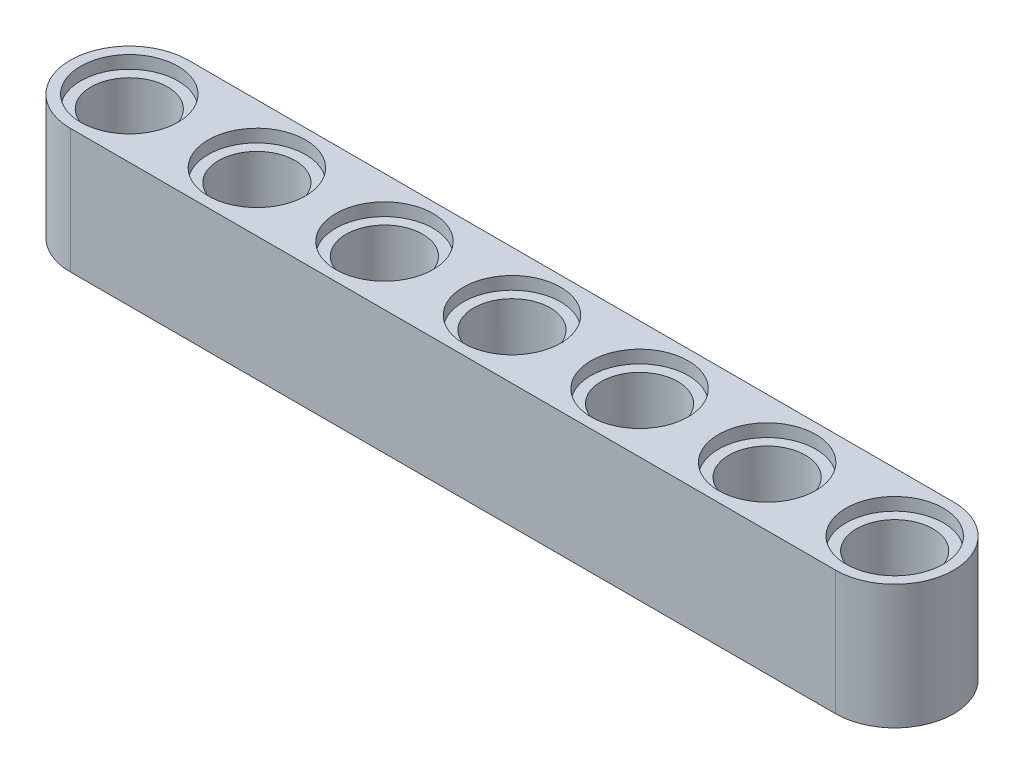
ISO-10303-21;
HEADER;
FILE_DESCRIPTION(('STEP AP214'),'2;1');
FILE_NAME('part.step','',(''),(''),'','','');
FILE_SCHEMA(('AUTOMOTIVE_DESIGN { 1 0 10303 214 1 1 1 1 }'));
ENDSEC;
DATA;
#1=APPLICATION_CONTEXT('core data for automotive mechanical design processes');
#2=APPLICATION_PROTOCOL_DEFINITION('international standard','automotive_design',2000,#1);
#3=PRODUCT_CONTEXT('',#1,'mechanical');
#4=PRODUCT('Part','Part','',(#3));
#5=PRODUCT_RELATED_PRODUCT_CATEGORY('part','',(#4));
#6=PRODUCT_DEFINITION_FORMATION('','',#4);
#7=PRODUCT_DEFINITION_CONTEXT('part definition',#1,'design');
#8=PRODUCT_DEFINITION('design','',#6,#7);
#9=PRODUCT_DEFINITION_SHAPE('','',#8);
#10=(LENGTH_UNIT() NAMED_UNIT(*) SI_UNIT(.MILLI.,.METRE.));
#11=(NAMED_UNIT(*) PLANE_ANGLE_UNIT() SI_UNIT($,.RADIAN.));
#12=(NAMED_UNIT(*) SI_UNIT($,.STERADIAN.) SOLID_ANGLE_UNIT());
#13=UNCERTAINTY_MEASURE_WITH_UNIT(LENGTH_MEASURE(1.E-05),#10,'distance_accuracy_value','');
#14=(GEOMETRIC_REPRESENTATION_CONTEXT(3) GLOBAL_UNCERTAINTY_ASSIGNED_CONTEXT((#13)) GLOBAL_UNIT_ASSIGNED_CONTEXT((#10,
#11,#12)) REPRESENTATION_CONTEXT('',''));
#15=CARTESIAN_POINT('',(0.,0.,0.));
#16=DIRECTION('',(0.,0.,1.));
#17=DIRECTION('',(1.,0.,0.));
#18=AXIS2_PLACEMENT_3D('',#15,#16,#17);
#19=CARTESIAN_POINT('',(0.,0.,0.));
#20=DIRECTION('',(0.,1.,0.));
#21=DIRECTION('',(0.,0.,1.));
#22=AXIS2_PLACEMENT_3D('',#19,#20,#21);
#23=CYLINDRICAL_SURFACE('',#22,2.4);
#24=CARTESIAN_POINT('',(0.,7.,0.));
#25=DIRECTION('',(0.,1.,0.));
#26=DIRECTION('',(0.,0.,1.));
#27=AXIS2_PLACEMENT_3D('',#24,#25,#26);
#28=CIRCLE('',#27,2.4);
#29=CARTESIAN_POINT('',(0.,7.,2.4));
#30=VERTEX_POINT('',#29);
#31=EDGE_CURVE('E109',#30,#30,#28,.F.);
#32=ORIENTED_EDGE('',*,*,#31,.F.);
#33=EDGE_LOOP('',(#32));
#34=FACE_BOUND('',#33,.T.);
#35=CARTESIAN_POINT('',(0.,0.8,0.));
#36=DIRECTION('',(0.,-1.,0.));
#37=DIRECTION('',(0.,0.,-1.));
#38=AXIS2_PLACEMENT_3D('',#35,#36,#37);
#39=CIRCLE('',#38,2.4);
#40=CARTESIAN_POINT('',(0.,0.8,-2.4));
#41=VERTEX_POINT('',#40);
#42=EDGE_CURVE('E40',#41,#41,#39,.F.);
#43=ORIENTED_EDGE('',*,*,#42,.F.);
#44=EDGE_LOOP('',(#43));
#45=FACE_BOUND('',#44,.T.);
#46=ADVANCED_FACE('F36',(#34,#45),#23,.F.);
#47=CARTESIAN_POINT('',(8.,0.,0.));
#48=DIRECTION('',(0.,1.,0.));
#49=DIRECTION('',(0.,0.,1.));
#50=AXIS2_PLACEMENT_3D('',#47,#48,#49);
#51=CYLINDRICAL_SURFACE('',#50,2.4);
#52=CARTESIAN_POINT('',(8.,7.,0.));
#53=DIRECTION('',(0.,1.,0.));
#54=DIRECTION('',(0.,0.,1.));
#55=AXIS2_PLACEMENT_3D('',#52,#53,#54);
#56=CIRCLE('',#55,2.4);
#57=CARTESIAN_POINT('',(8.,7.,2.4));
#58=VERTEX_POINT('',#57);
#59=EDGE_CURVE('E125',#58,#58,#56,.F.);
#60=ORIENTED_EDGE('',*,*,#59,.F.);
#61=EDGE_LOOP('',(#60));
#62=FACE_BOUND('',#61,.T.);
#63=CARTESIAN_POINT('',(8.,0.8,0.));
#64=DIRECTION('',(0.,-1.,0.));
#65=DIRECTION('',(0.,0.,-1.));
#66=AXIS2_PLACEMENT_3D('',#63,#64,#65);
#67=CIRCLE('',#66,2.4);
#68=CARTESIAN_POINT('',(8.,0.8,-2.4));
#69=VERTEX_POINT('',#68);
#70=EDGE_CURVE('E151',#69,#69,#67,.F.);
#71=ORIENTED_EDGE('',*,*,#70,.F.);
#72=EDGE_LOOP('',(#71));
#73=FACE_BOUND('',#72,.T.);
#74=ADVANCED_FACE('F241',(#62,#73),#51,.F.);
#75=CARTESIAN_POINT('',(-16.,0.,0.));
#76=DIRECTION('',(0.,1.,0.));
#77=DIRECTION('',(0.,0.,1.));
#78=AXIS2_PLACEMENT_3D('',#75,#76,#77);
#79=CYLINDRICAL_SURFACE('',#78,2.4);
#80=CARTESIAN_POINT('',(-16.,7.,0.));
#81=DIRECTION('',(0.,1.,0.));
#82=DIRECTION('',(0.,0.,1.));
#83=AXIS2_PLACEMENT_3D('',#80,#81,#82);
#84=CIRCLE('',#83,2.4);
#85=CARTESIAN_POINT('',(-16.,7.,2.4));
#86=VERTEX_POINT('',#85);
#87=EDGE_CURVE('E118',#86,#86,#84,.F.);
#88=ORIENTED_EDGE('',*,*,#87,.F.);
#89=EDGE_LOOP('',(#88));
#90=FACE_BOUND('',#89,.T.);
#91=CARTESIAN_POINT('',(-16.,0.8,0.));
#92=DIRECTION('',(0.,-1.,0.));
#93=DIRECTION('',(0.,0.,-1.));
#94=AXIS2_PLACEMENT_3D('',#91,#92,#93);
#95=CIRCLE('',#94,2.4);
#96=CARTESIAN_POINT('',(-16.,0.8,-2.4));
#97=VERTEX_POINT('',#96);
#98=EDGE_CURVE('E149',#97,#97,#95,.F.);
#99=ORIENTED_EDGE('',*,*,#98,.F.);
#100=EDGE_LOOP('',(#99));
#101=FACE_BOUND('',#100,.T.);
#102=ADVANCED_FACE('F247',(#90,#101),#79,.F.);
#103=CARTESIAN_POINT('',(24.,0.,0.));
#104=DIRECTION('',(0.,1.,0.));
#105=DIRECTION('',(0.,0.,1.));
#106=AXIS2_PLACEMENT_3D('',#103,#104,#105);
#107=CYLINDRICAL_SURFACE('',#106,2.4);
#108=CARTESIAN_POINT('',(24.,7.,0.));
#109=DIRECTION('',(0.,1.,0.));
#110=DIRECTION('',(0.,0.,1.));
#111=AXIS2_PLACEMENT_3D('',#108,#109,#110);
#112=CIRCLE('',#111,2.4);
#113=CARTESIAN_POINT('',(24.,7.,2.4));
#114=VERTEX_POINT('',#113);
#115=EDGE_CURVE('E115',#114,#114,#112,.F.);
#116=ORIENTED_EDGE('',*,*,#115,.F.);
#117=EDGE_LOOP('',(#116));
#118=FACE_BOUND('',#117,.T.);
#119=CARTESIAN_POINT('',(24.,0.8,0.));
#120=DIRECTION('',(0.,-1.,0.));
#121=DIRECTION('',(0.,0.,-1.));
#122=AXIS2_PLACEMENT_3D('',#119,#120,#121);
#123=CIRCLE('',#122,2.4);
#124=CARTESIAN_POINT('',(24.,0.8,-2.4));
#125=VERTEX_POINT('',#124);
#126=EDGE_CURVE('E146',#125,#125,#123,.F.);
#127=ORIENTED_EDGE('',*,*,#126,.F.);
#128=EDGE_LOOP('',(#127));
#129=FACE_BOUND('',#128,.T.);
#130=ADVANCED_FACE('F421',(#118,#129),#107,.F.);
#131=CARTESIAN_POINT('',(-16.,7.8,-3.7));
#132=DIRECTION('',(0.,0.,-1.));
#133=DIRECTION('',(-1.,0.,0.));
#134=AXIS2_PLACEMENT_3D('',#131,#132,#133);
#135=PLANE('',#134);
#136=DIRECTION('',(1.,0.,0.));
#137=VECTOR('',#136,1.);
#138=CARTESIAN_POINT('',(-16.,0.,-3.7));
#139=LINE('',#138,#137);
#140=CARTESIAN_POINT('',(-16.,0.,-3.7));
#141=VERTEX_POINT('',#140);
#142=CARTESIAN_POINT('',(32.,0.,-3.7));
#143=VERTEX_POINT('',#142);
#144=EDGE_CURVE('E105',#141,#143,#139,.T.);
#145=ORIENTED_EDGE('',*,*,#144,.F.);
#146=DIRECTION('',(0.,-1.,0.));
#147=VECTOR('',#146,1.);
#148=CARTESIAN_POINT('',(-16.,7.8,-3.7));
#149=LINE('',#148,#147);
#150=CARTESIAN_POINT('',(-16.,7.8,-3.7));
#151=VERTEX_POINT('',#150);
#152=EDGE_CURVE('E11',#151,#141,#149,.T.);
#153=ORIENTED_EDGE('',*,*,#152,.F.);
#154=DIRECTION('',(1.,0.,0.));
#155=VECTOR('',#154,1.);
#156=CARTESIAN_POINT('',(-16.,7.8,-3.7));
#157=LINE('',#156,#155);
#158=CARTESIAN_POINT('',(32.,7.8,-3.7));
#159=VERTEX_POINT('',#158);
#160=EDGE_CURVE('E99',#151,#159,#157,.T.);
#161=ORIENTED_EDGE('',*,*,#160,.T.);
#162=DIRECTION('',(0.,-1.,0.));
#163=VECTOR('',#162,1.);
#164=CARTESIAN_POINT('',(32.,7.8,-3.7));
#165=LINE('',#164,#163);
#166=EDGE_CURVE('E78',#159,#143,#165,.T.);
#167=ORIENTED_EDGE('',*,*,#166,.T.);
#168=EDGE_LOOP('',(#145,#153,#161,#167));
#169=FACE_BOUND('',#168,.T.);
#170=ADVANCED_FACE('F38',(#169),#135,.T.);
#171=CARTESIAN_POINT('',(-16.,7.8,0.));
#172=DIRECTION('',(0.,-1.,0.));
#173=DIRECTION('',(0.,0.,-1.));
#174=AXIS2_PLACEMENT_3D('',#171,#172,#173);
#175=CYLINDRICAL_SURFACE('',#174,3.7);
#176=CARTESIAN_POINT('',(-16.,0.,0.));
#177=DIRECTION('',(0.,1.,0.));
#178=DIRECTION('',(0.,0.,1.));
#179=AXIS2_PLACEMENT_3D('',#176,#177,#178);
#180=CIRCLE('',#179,3.7);
#181=CARTESIAN_POINT('',(-16.,0.,3.7));
#182=VERTEX_POINT('',#181);
#183=EDGE_CURVE('E70',#141,#182,#180,.T.);
#184=ORIENTED_EDGE('',*,*,#183,.T.);
#185=DIRECTION('',(0.,-1.,0.));
#186=VECTOR('',#185,1.);
#187=CARTESIAN_POINT('',(-16.,7.8,3.7));
#188=LINE('',#187,#186);
#189=CARTESIAN_POINT('',(-16.,7.8,3.7));
#190=VERTEX_POINT('',#189);
#191=EDGE_CURVE('E46',#190,#182,#188,.T.);
#192=ORIENTED_EDGE('',*,*,#191,.F.);
#193=CARTESIAN_POINT('',(-16.,7.8,0.));
#194=DIRECTION('',(0.,1.,0.));
#195=DIRECTION('',(0.,0.,1.));
#196=AXIS2_PLACEMENT_3D('',#193,#194,#195);
#197=CIRCLE('',#196,3.7);
#198=EDGE_CURVE('E88',#151,#190,#197,.T.);
#199=ORIENTED_EDGE('',*,*,#198,.F.);
#200=ORIENTED_EDGE('',*,*,#152,.T.);
#201=EDGE_LOOP('',(#184,#192,#199,#200));
#202=FACE_BOUND('',#201,.T.);
#203=ADVANCED_FACE('F259',(#202),#175,.T.);
#204=CARTESIAN_POINT('',(-16.,7.8,3.7));
#205=DIRECTION('',(0.,0.,-1.));
#206=DIRECTION('',(-1.,0.,0.));
#207=AXIS2_PLACEMENT_3D('',#204,#205,#206);
#208=PLANE('',#207);
#209=DIRECTION('',(1.,0.,0.));
#210=VECTOR('',#209,1.);
#211=CARTESIAN_POINT('',(-16.,0.,3.7));
#212=LINE('',#211,#210);
#213=CARTESIAN_POINT('',(32.,0.,3.7));
#214=VERTEX_POINT('',#213);
#215=EDGE_CURVE('E95',#182,#214,#212,.T.);
#216=ORIENTED_EDGE('',*,*,#215,.T.);
#217=DIRECTION('',(0.,-1.,0.));
#218=VECTOR('',#217,1.);
#219=CARTESIAN_POINT('',(32.,7.8,3.7));
#220=LINE('',#219,#218);
#221=CARTESIAN_POINT('',(32.,7.8,3.7));
#222=VERTEX_POINT('',#221);
#223=EDGE_CURVE('E92',#222,#214,#220,.T.);
#224=ORIENTED_EDGE('',*,*,#223,.F.);
#225=DIRECTION('',(1.,0.,0.));
#226=VECTOR('',#225,1.);
#227=CARTESIAN_POINT('',(-16.,7.8,3.7));
#228=LINE('',#227,#226);
#229=EDGE_CURVE('E83',#190,#222,#228,.T.);
#230=ORIENTED_EDGE('',*,*,#229,.F.);
#231=ORIENTED_EDGE('',*,*,#191,.T.);
#232=EDGE_LOOP('',(#216,#224,#230,#231));
#233=FACE_BOUND('',#232,.T.);
#234=ADVANCED_FACE('F93',(#233),#208,.F.);
#235=CARTESIAN_POINT('',(32.,7.8,0.));
#236=DIRECTION('',(0.,-1.,0.));
#237=DIRECTION('',(0.,0.,-1.));
#238=AXIS2_PLACEMENT_3D('',#235,#236,#237);
#239=CYLINDRICAL_SURFACE('',#238,3.7);
#240=CARTESIAN_POINT('',(32.,0.,0.));
#241=DIRECTION('',(0.,-1.,0.));
#242=DIRECTION('',(0.,0.,-1.));
#243=AXIS2_PLACEMENT_3D('',#240,#241,#242);
#244=CIRCLE('',#243,3.7);
#245=EDGE_CURVE('E108',#143,#214,#244,.T.);
#246=ORIENTED_EDGE('',*,*,#245,.F.);
#247=ORIENTED_EDGE('',*,*,#166,.F.);
#248=CARTESIAN_POINT('',(32.,7.8,0.));
#249=DIRECTION('',(0.,-1.,0.));
#250=DIRECTION('',(0.,0.,-1.));
#251=AXIS2_PLACEMENT_3D('',#248,#249,#250);
#252=CIRCLE('',#251,3.7);
#253=EDGE_CURVE('E87',#159,#222,#252,.T.);
#254=ORIENTED_EDGE('',*,*,#253,.T.);
#255=ORIENTED_EDGE('',*,*,#223,.T.);
#256=EDGE_LOOP('',(#246,#247,#254,#255));
#257=FACE_BOUND('',#256,.T.);
#258=ADVANCED_FACE('F98',(#257),#239,.T.);
#259=CARTESIAN_POINT('',(32.,7.8,0.));
#260=DIRECTION('',(0.,-1.,0.));
#261=DIRECTION('',(0.,0.,-1.));
#262=AXIS2_PLACEMENT_3D('',#259,#260,#261);
#263=PLANE('',#262);
#264=CARTESIAN_POINT('',(24.,7.8,0.));
#265=DIRECTION('',(0.,1.,0.));
#266=DIRECTION('',(0.,0.,1.));
#267=AXIS2_PLACEMENT_3D('',#264,#265,#266);
#268=CIRCLE('',#267,3.05);
#269=CARTESIAN_POINT('',(24.,7.8,3.05));
#270=VERTEX_POINT('',#269);
#271=EDGE_CURVE('E156',#270,#270,#268,.T.);
#272=ORIENTED_EDGE('',*,*,#271,.F.);
#273=EDGE_LOOP('',(#272));
#274=FACE_BOUND('',#273,.T.);
#275=CARTESIAN_POINT('',(32.,7.8,0.));
#276=DIRECTION('',(0.,1.,0.));
#277=DIRECTION('',(0.,0.,-1.));
#278=AXIS2_PLACEMENT_3D('',#275,#276,#277);
#279=CIRCLE('',#278,3.05);
#280=CARTESIAN_POINT('',(32.,7.8,-3.05));
#281=VERTEX_POINT('',#280);
#282=EDGE_CURVE('E165',#281,#281,#279,.T.);
#283=ORIENTED_EDGE('',*,*,#282,.F.);
#284=EDGE_LOOP('',(#283));
#285=FACE_BOUND('',#284,.T.);
#286=CARTESIAN_POINT('',(-8.,7.8,0.));
#287=DIRECTION('',(0.,1.,0.));
#288=DIRECTION('',(0.,0.,-1.));
#289=AXIS2_PLACEMENT_3D('',#286,#287,#288);
#290=CIRCLE('',#289,3.05);
#291=CARTESIAN_POINT('',(-8.,7.8,-3.05));
#292=VERTEX_POINT('',#291);
#293=EDGE_CURVE('E201',#292,#292,#290,.T.);
#294=ORIENTED_EDGE('',*,*,#293,.F.);
#295=EDGE_LOOP('',(#294));
#296=FACE_BOUND('',#295,.T.);
#297=CARTESIAN_POINT('',(-16.,7.8,0.));
#298=DIRECTION('',(0.,1.,0.));
#299=DIRECTION('',(0.,0.,1.));
#300=AXIS2_PLACEMENT_3D('',#297,#298,#299);
#301=CIRCLE('',#300,3.05);
#302=CARTESIAN_POINT('',(-16.,7.8,3.05));
#303=VERTEX_POINT('',#302);
#304=EDGE_CURVE('E195',#303,#303,#301,.T.);
#305=ORIENTED_EDGE('',*,*,#304,.F.);
#306=EDGE_LOOP('',(#305));
#307=FACE_BOUND('',#306,.T.);
#308=CARTESIAN_POINT('',(16.,7.8,0.));
#309=DIRECTION('',(0.,1.,0.));
#310=DIRECTION('',(0.,0.,-1.));
#311=AXIS2_PLACEMENT_3D('',#308,#309,#310);
#312=CIRCLE('',#311,3.05);
#313=CARTESIAN_POINT('',(16.,7.8,-3.05));
#314=VERTEX_POINT('',#313);
#315=EDGE_CURVE('E189',#314,#314,#312,.T.);
#316=ORIENTED_EDGE('',*,*,#315,.F.);
#317=EDGE_LOOP('',(#316));
#318=FACE_BOUND('',#317,.T.);
#319=CARTESIAN_POINT('',(0.,7.8,0.));
#320=DIRECTION('',(0.,1.,0.));
#321=DIRECTION('',(0.,0.,1.));
#322=AXIS2_PLACEMENT_3D('',#319,#320,#321);
#323=CIRCLE('',#322,3.05);
#324=CARTESIAN_POINT('',(0.,7.8,3.05));
#325=VERTEX_POINT('',#324);
#326=EDGE_CURVE('E176',#325,#325,#323,.T.);
#327=ORIENTED_EDGE('',*,*,#326,.F.);
#328=EDGE_LOOP('',(#327));
#329=FACE_BOUND('',#328,.T.);
#330=CARTESIAN_POINT('',(8.,7.8,0.));
#331=DIRECTION('',(0.,1.,0.));
#332=DIRECTION('',(0.,0.,1.));
#333=AXIS2_PLACEMENT_3D('',#330,#331,#332);
#334=CIRCLE('',#333,3.05);
#335=CARTESIAN_POINT('',(8.,7.8,3.05));
#336=VERTEX_POINT('',#335);
#337=EDGE_CURVE('E170',#336,#336,#334,.T.);
#338=ORIENTED_EDGE('',*,*,#337,.F.);
#339=EDGE_LOOP('',(#338));
#340=FACE_BOUND('',#339,.T.);
#341=ORIENTED_EDGE('',*,*,#160,.F.);
#342=ORIENTED_EDGE('',*,*,#198,.T.);
#343=ORIENTED_EDGE('',*,*,#229,.T.);
#344=ORIENTED_EDGE('',*,*,#253,.F.);
#345=EDGE_LOOP('',(#341,#342,#343,#344));
#346=FACE_BOUND('',#345,.T.);
#347=ADVANCED_FACE('F86',(#274,#285,#296,#307,#318,#329,#340,#346),#263,.F.);
#348=CARTESIAN_POINT('',(32.,0.,0.));
#349=DIRECTION('',(0.,-1.,0.));
#350=DIRECTION('',(0.,0.,-1.));
#351=AXIS2_PLACEMENT_3D('',#348,#349,#350);
#352=PLANE('',#351);
#353=CARTESIAN_POINT('',(24.,0.,0.));
#354=DIRECTION('',(0.,-1.,0.));
#355=DIRECTION('',(0.,0.,-1.));
#356=AXIS2_PLACEMENT_3D('',#353,#354,#355);
#357=CIRCLE('',#356,3.05);
#358=CARTESIAN_POINT('',(24.,0.,-3.05));
#359=VERTEX_POINT('',#358);
#360=EDGE_CURVE('E566',#359,#359,#357,.T.);
#361=ORIENTED_EDGE('',*,*,#360,.F.);
#362=EDGE_LOOP('',(#361));
#363=FACE_BOUND('',#362,.T.);
#364=CARTESIAN_POINT('',(32.,0.,0.));
#365=DIRECTION('',(0.,-1.,0.));
#366=DIRECTION('',(0.,0.,1.));
#367=AXIS2_PLACEMENT_3D('',#364,#365,#366);
#368=CIRCLE('',#367,3.05);
#369=CARTESIAN_POINT('',(32.,0.,3.05));
#370=VERTEX_POINT('',#369);
#371=EDGE_CURVE('E561',#370,#370,#368,.T.);
#372=ORIENTED_EDGE('',*,*,#371,.F.);
#373=EDGE_LOOP('',(#372));
#374=FACE_BOUND('',#373,.T.);
#375=CARTESIAN_POINT('',(-8.,0.,0.));
#376=DIRECTION('',(0.,-1.,0.));
#377=DIRECTION('',(0.,0.,1.));
#378=AXIS2_PLACEMENT_3D('',#375,#376,#377);
#379=CIRCLE('',#378,3.05);
#380=CARTESIAN_POINT('',(-8.,0.,3.05));
#381=VERTEX_POINT('',#380);
#382=EDGE_CURVE('E555',#381,#381,#379,.T.);
#383=ORIENTED_EDGE('',*,*,#382,.F.);
#384=EDGE_LOOP('',(#383));
#385=FACE_BOUND('',#384,.T.);
#386=CARTESIAN_POINT('',(-16.,0.,0.));
#387=DIRECTION('',(0.,-1.,0.));
#388=DIRECTION('',(0.,0.,-1.));
#389=AXIS2_PLACEMENT_3D('',#386,#387,#388);
#390=CIRCLE('',#389,3.05);
#391=CARTESIAN_POINT('',(-16.,0.,-3.05));
#392=VERTEX_POINT('',#391);
#393=EDGE_CURVE('E549',#392,#392,#390,.T.);
#394=ORIENTED_EDGE('',*,*,#393,.F.);
#395=EDGE_LOOP('',(#394));
#396=FACE_BOUND('',#395,.T.);
#397=CARTESIAN_POINT('',(16.,0.,0.));
#398=DIRECTION('',(0.,-1.,0.));
#399=DIRECTION('',(0.,0.,1.));
#400=AXIS2_PLACEMENT_3D('',#397,#398,#399);
#401=CIRCLE('',#400,3.05);
#402=CARTESIAN_POINT('',(16.,0.,3.05));
#403=VERTEX_POINT('',#402);
#404=EDGE_CURVE('E543',#403,#403,#401,.T.);
#405=ORIENTED_EDGE('',*,*,#404,.F.);
#406=EDGE_LOOP('',(#405));
#407=FACE_BOUND('',#406,.T.);
#408=CARTESIAN_POINT('',(0.,0.,0.));
#409=DIRECTION('',(0.,-1.,0.));
#410=DIRECTION('',(0.,0.,-1.));
#411=AXIS2_PLACEMENT_3D('',#408,#409,#410);
#412=CIRCLE('',#411,3.05);
#413=CARTESIAN_POINT('',(0.,0.,-3.05));
#414=VERTEX_POINT('',#413);
#415=EDGE_CURVE('E534',#414,#414,#412,.T.);
#416=ORIENTED_EDGE('',*,*,#415,.F.);
#417=EDGE_LOOP('',(#416));
#418=FACE_BOUND('',#417,.T.);
#419=CARTESIAN_POINT('',(8.,0.,0.));
#420=DIRECTION('',(0.,-1.,0.));
#421=DIRECTION('',(0.,0.,-1.));
#422=AXIS2_PLACEMENT_3D('',#419,#420,#421);
#423=CIRCLE('',#422,3.05);
#424=CARTESIAN_POINT('',(8.,0.,-3.05));
#425=VERTEX_POINT('',#424);
#426=EDGE_CURVE('E184',#425,#425,#423,.T.);
#427=ORIENTED_EDGE('',*,*,#426,.F.);
#428=EDGE_LOOP('',(#427));
#429=FACE_BOUND('',#428,.T.);
#430=ORIENTED_EDGE('',*,*,#144,.T.);
#431=ORIENTED_EDGE('',*,*,#245,.T.);
#432=ORIENTED_EDGE('',*,*,#215,.F.);
#433=ORIENTED_EDGE('',*,*,#183,.F.);
#434=EDGE_LOOP('',(#430,#431,#432,#433));
#435=FACE_BOUND('',#434,.T.);
#436=ADVANCED_FACE('F213',(#363,#374,#385,#396,#407,#418,#429,#435),#352,.T.);
#437=CARTESIAN_POINT('',(32.,0.,0.));
#438=DIRECTION('',(0.,1.,0.));
#439=DIRECTION('',(0.,0.,1.));
#440=AXIS2_PLACEMENT_3D('',#437,#438,#439);
#441=CYLINDRICAL_SURFACE('',#440,2.4);
#442=CARTESIAN_POINT('',(32.,0.8,0.));
#443=DIRECTION('',(0.,1.,0.));
#444=DIRECTION('',(0.,0.,1.));
#445=AXIS2_PLACEMENT_3D('',#442,#443,#444);
#446=CIRCLE('',#445,2.4);
#447=CARTESIAN_POINT('',(32.,0.8,2.4));
#448=VERTEX_POINT('',#447);
#449=EDGE_CURVE('E143',#448,#448,#446,.F.);
#450=ORIENTED_EDGE('',*,*,#449,.T.);
#451=EDGE_LOOP('',(#450));
#452=FACE_BOUND('',#451,.T.);
#453=CARTESIAN_POINT('',(32.,7.,0.));
#454=DIRECTION('',(0.,-1.,0.));
#455=DIRECTION('',(0.,0.,-1.));
#456=AXIS2_PLACEMENT_3D('',#453,#454,#455);
#457=CIRCLE('',#456,2.4);
#458=CARTESIAN_POINT('',(32.,7.,-2.4));
#459=VERTEX_POINT('',#458);
#460=EDGE_CURVE('E131',#459,#459,#457,.F.);
#461=ORIENTED_EDGE('',*,*,#460,.T.);
#462=EDGE_LOOP('',(#461));
#463=FACE_BOUND('',#462,.T.);
#464=ADVANCED_FACE('F257',(#452,#463),#441,.F.);
#465=CARTESIAN_POINT('',(-8.,0.,0.));
#466=DIRECTION('',(0.,1.,0.));
#467=DIRECTION('',(0.,0.,1.));
#468=AXIS2_PLACEMENT_3D('',#465,#466,#467);
#469=CYLINDRICAL_SURFACE('',#468,2.4);
#470=CARTESIAN_POINT('',(-8.,0.8,0.));
#471=DIRECTION('',(0.,1.,0.));
#472=DIRECTION('',(0.,0.,1.));
#473=AXIS2_PLACEMENT_3D('',#470,#471,#472);
#474=CIRCLE('',#473,2.4);
#475=CARTESIAN_POINT('',(-8.,0.8,2.4));
#476=VERTEX_POINT('',#475);
#477=EDGE_CURVE('E139',#476,#476,#474,.F.);
#478=ORIENTED_EDGE('',*,*,#477,.T.);
#479=EDGE_LOOP('',(#478));
#480=FACE_BOUND('',#479,.T.);
#481=CARTESIAN_POINT('',(-8.,7.,0.));
#482=DIRECTION('',(0.,-1.,0.));
#483=DIRECTION('',(0.,0.,-1.));
#484=AXIS2_PLACEMENT_3D('',#481,#482,#483);
#485=CIRCLE('',#484,2.4);
#486=CARTESIAN_POINT('',(-8.,7.,-2.4));
#487=VERTEX_POINT('',#486);
#488=EDGE_CURVE('E128',#487,#487,#485,.F.);
#489=ORIENTED_EDGE('',*,*,#488,.T.);
#490=EDGE_LOOP('',(#489));
#491=FACE_BOUND('',#490,.T.);
#492=ADVANCED_FACE('F284',(#480,#491),#469,.F.);
#493=CARTESIAN_POINT('',(16.,0.,0.));
#494=DIRECTION('',(0.,1.,0.));
#495=DIRECTION('',(0.,0.,1.));
#496=AXIS2_PLACEMENT_3D('',#493,#494,#495);
#497=CYLINDRICAL_SURFACE('',#496,2.4);
#498=CARTESIAN_POINT('',(16.,0.8,0.));
#499=DIRECTION('',(0.,1.,0.));
#500=DIRECTION('',(0.,0.,1.));
#501=AXIS2_PLACEMENT_3D('',#498,#499,#500);
#502=CIRCLE('',#501,2.4);
#503=CARTESIAN_POINT('',(16.,0.8,2.4));
#504=VERTEX_POINT('',#503);
#505=EDGE_CURVE('E136',#504,#504,#502,.F.);
#506=ORIENTED_EDGE('',*,*,#505,.T.);
#507=EDGE_LOOP('',(#506));
#508=FACE_BOUND('',#507,.T.);
#509=CARTESIAN_POINT('',(16.,7.,0.));
#510=DIRECTION('',(0.,-1.,0.));
#511=DIRECTION('',(0.,0.,-1.));
#512=AXIS2_PLACEMENT_3D('',#509,#510,#511);
#513=CIRCLE('',#512,2.4);
#514=CARTESIAN_POINT('',(16.,7.,-2.4));
#515=VERTEX_POINT('',#514);
#516=EDGE_CURVE('E122',#515,#515,#513,.F.);
#517=ORIENTED_EDGE('',*,*,#516,.T.);
#518=EDGE_LOOP('',(#517));
#519=FACE_BOUND('',#518,.T.);
#520=ADVANCED_FACE('F253',(#508,#519),#497,.F.);
#521=CARTESIAN_POINT('',(24.,7.,0.));
#522=DIRECTION('',(0.,1.,0.));
#523=DIRECTION('',(0.,0.,1.));
#524=AXIS2_PLACEMENT_3D('',#521,#522,#523);
#525=PLANE('',#524);
#526=CARTESIAN_POINT('',(24.,7.,0.));
#527=DIRECTION('',(0.,1.,0.));
#528=DIRECTION('',(0.,0.,1.));
#529=AXIS2_PLACEMENT_3D('',#526,#527,#528);
#530=CIRCLE('',#529,3.05);
#531=CARTESIAN_POINT('',(24.,7.,3.05));
#532=VERTEX_POINT('',#531);
#533=EDGE_CURVE('E160',#532,#532,#530,.T.);
#534=ORIENTED_EDGE('',*,*,#533,.T.);
#535=EDGE_LOOP('',(#534));
#536=FACE_BOUND('',#535,.T.);
#537=ORIENTED_EDGE('',*,*,#115,.T.);
#538=EDGE_LOOP('',(#537));
#539=FACE_BOUND('',#538,.T.);
#540=ADVANCED_FACE('F299',(#536,#539),#525,.T.);
#541=CARTESIAN_POINT('',(24.,7.,0.));
#542=DIRECTION('',(0.,1.,0.));
#543=DIRECTION('',(0.,0.,1.));
#544=AXIS2_PLACEMENT_3D('',#541,#542,#543);
#545=CYLINDRICAL_SURFACE('',#544,3.05);
#546=ORIENTED_EDGE('',*,*,#533,.F.);
#547=EDGE_LOOP('',(#546));
#548=FACE_BOUND('',#547,.T.);
#549=ORIENTED_EDGE('',*,*,#271,.T.);
#550=EDGE_LOOP('',(#549));
#551=FACE_BOUND('',#550,.T.);
#552=ADVANCED_FACE('F306',(#548,#551),#545,.F.);
#553=CARTESIAN_POINT('',(-16.,7.,0.));
#554=DIRECTION('',(0.,1.,0.));
#555=DIRECTION('',(0.,0.,1.));
#556=AXIS2_PLACEMENT_3D('',#553,#554,#555);
#557=PLANE('',#556);
#558=CARTESIAN_POINT('',(-16.,7.,0.));
#559=DIRECTION('',(0.,1.,0.));
#560=DIRECTION('',(0.,0.,1.));
#561=AXIS2_PLACEMENT_3D('',#558,#559,#560);
#562=CIRCLE('',#561,3.05);
#563=CARTESIAN_POINT('',(-16.,7.,3.05));
#564=VERTEX_POINT('',#563);
#565=EDGE_CURVE('E192',#564,#564,#562,.T.);
#566=ORIENTED_EDGE('',*,*,#565,.T.);
#567=EDGE_LOOP('',(#566));
#568=FACE_BOUND('',#567,.T.);
#569=ORIENTED_EDGE('',*,*,#87,.T.);
#570=EDGE_LOOP('',(#569));
#571=FACE_BOUND('',#570,.T.);
#572=ADVANCED_FACE('F314',(#568,#571),#557,.T.);
#573=CARTESIAN_POINT('',(-16.,7.,0.));
#574=DIRECTION('',(0.,1.,0.));
#575=DIRECTION('',(0.,0.,1.));
#576=AXIS2_PLACEMENT_3D('',#573,#574,#575);
#577=CYLINDRICAL_SURFACE('',#576,3.05);
#578=ORIENTED_EDGE('',*,*,#565,.F.);
#579=EDGE_LOOP('',(#578));
#580=FACE_BOUND('',#579,.T.);
#581=ORIENTED_EDGE('',*,*,#304,.T.);
#582=EDGE_LOOP('',(#581));
#583=FACE_BOUND('',#582,.T.);
#584=ADVANCED_FACE('F322',(#580,#583),#577,.F.);
#585=CARTESIAN_POINT('',(16.,7.,0.));
#586=DIRECTION('',(0.,-1.,0.));
#587=DIRECTION('',(0.,0.,-1.));
#588=AXIS2_PLACEMENT_3D('',#585,#586,#587);
#589=PLANE('',#588);
#590=CARTESIAN_POINT('',(16.,7.,0.));
#591=DIRECTION('',(0.,1.,0.));
#592=DIRECTION('',(0.,0.,-1.));
#593=AXIS2_PLACEMENT_3D('',#590,#591,#592);
#594=CIRCLE('',#593,3.05);
#595=CARTESIAN_POINT('',(16.,7.,-3.05));
#596=VERTEX_POINT('',#595);
#597=EDGE_CURVE('E181',#596,#596,#594,.T.);
#598=ORIENTED_EDGE('',*,*,#597,.T.);
#599=EDGE_LOOP('',(#598));
#600=FACE_BOUND('',#599,.T.);
#601=ORIENTED_EDGE('',*,*,#516,.F.);
#602=EDGE_LOOP('',(#601));
#603=FACE_BOUND('',#602,.T.);
#604=ADVANCED_FACE('F330',(#600,#603),#589,.F.);
#605=CARTESIAN_POINT('',(16.,7.,0.));
#606=DIRECTION('',(0.,1.,0.));
#607=DIRECTION('',(0.,0.,1.));
#608=AXIS2_PLACEMENT_3D('',#605,#606,#607);
#609=CYLINDRICAL_SURFACE('',#608,3.05);
#610=ORIENTED_EDGE('',*,*,#597,.F.);
#611=EDGE_LOOP('',(#610));
#612=FACE_BOUND('',#611,.T.);
#613=ORIENTED_EDGE('',*,*,#315,.T.);
#614=EDGE_LOOP('',(#613));
#615=FACE_BOUND('',#614,.T.);
#616=ADVANCED_FACE('F338',(#612,#615),#609,.F.);
#617=CARTESIAN_POINT('',(8.,7.,0.));
#618=DIRECTION('',(0.,1.,0.));
#619=DIRECTION('',(0.,0.,1.));
#620=AXIS2_PLACEMENT_3D('',#617,#618,#619);
#621=PLANE('',#620);
#622=CARTESIAN_POINT('',(8.,7.,0.));
#623=DIRECTION('',(0.,1.,0.));
#624=DIRECTION('',(0.,0.,1.));
#625=AXIS2_PLACEMENT_3D('',#622,#623,#624);
#626=CIRCLE('',#625,3.05);
#627=CARTESIAN_POINT('',(8.,7.,3.05));
#628=VERTEX_POINT('',#627);
#629=EDGE_CURVE('E119',#628,#628,#626,.T.);
#630=ORIENTED_EDGE('',*,*,#629,.T.);
#631=EDGE_LOOP('',(#630));
#632=FACE_BOUND('',#631,.T.);
#633=ORIENTED_EDGE('',*,*,#59,.T.);
#634=EDGE_LOOP('',(#633));
#635=FACE_BOUND('',#634,.T.);
#636=ADVANCED_FACE('F345',(#632,#635),#621,.T.);
#637=CARTESIAN_POINT('',(8.,7.,0.));
#638=DIRECTION('',(0.,1.,0.));
#639=DIRECTION('',(0.,0.,1.));
#640=AXIS2_PLACEMENT_3D('',#637,#638,#639);
#641=CYLINDRICAL_SURFACE('',#640,3.05);
#642=ORIENTED_EDGE('',*,*,#629,.F.);
#643=EDGE_LOOP('',(#642));
#644=FACE_BOUND('',#643,.T.);
#645=ORIENTED_EDGE('',*,*,#337,.T.);
#646=EDGE_LOOP('',(#645));
#647=FACE_BOUND('',#646,.T.);
#648=ADVANCED_FACE('F353',(#644,#647),#641,.F.);
#649=CARTESIAN_POINT('',(-8.,7.,0.));
#650=DIRECTION('',(0.,-1.,0.));
#651=DIRECTION('',(0.,0.,-1.));
#652=AXIS2_PLACEMENT_3D('',#649,#650,#651);
#653=PLANE('',#652);
#654=CARTESIAN_POINT('',(-8.,7.,0.));
#655=DIRECTION('',(0.,1.,0.));
#656=DIRECTION('',(0.,0.,-1.));
#657=AXIS2_PLACEMENT_3D('',#654,#655,#656);
#658=CIRCLE('',#657,3.05);
#659=CARTESIAN_POINT('',(-8.,7.,-3.05));
#660=VERTEX_POINT('',#659);
#661=EDGE_CURVE('E198',#660,#660,#658,.T.);
#662=ORIENTED_EDGE('',*,*,#661,.T.);
#663=EDGE_LOOP('',(#662));
#664=FACE_BOUND('',#663,.T.);
#665=ORIENTED_EDGE('',*,*,#488,.F.);
#666=EDGE_LOOP('',(#665));
#667=FACE_BOUND('',#666,.T.);
#668=ADVANCED_FACE('F361',(#664,#667),#653,.F.);
#669=CARTESIAN_POINT('',(-8.,7.,0.));
#670=DIRECTION('',(0.,1.,0.));
#671=DIRECTION('',(0.,0.,1.));
#672=AXIS2_PLACEMENT_3D('',#669,#670,#671);
#673=CYLINDRICAL_SURFACE('',#672,3.05);
#674=ORIENTED_EDGE('',*,*,#661,.F.);
#675=EDGE_LOOP('',(#674));
#676=FACE_BOUND('',#675,.T.);
#677=ORIENTED_EDGE('',*,*,#293,.T.);
#678=EDGE_LOOP('',(#677));
#679=FACE_BOUND('',#678,.T.);
#680=ADVANCED_FACE('F369',(#676,#679),#673,.F.);
#681=CARTESIAN_POINT('',(32.,7.,0.));
#682=DIRECTION('',(0.,-1.,0.));
#683=DIRECTION('',(0.,0.,-1.));
#684=AXIS2_PLACEMENT_3D('',#681,#682,#683);
#685=PLANE('',#684);
#686=CARTESIAN_POINT('',(32.,7.,0.));
#687=DIRECTION('',(0.,1.,0.));
#688=DIRECTION('',(0.,0.,-1.));
#689=AXIS2_PLACEMENT_3D('',#686,#687,#688);
#690=CIRCLE('',#689,3.05);
#691=CARTESIAN_POINT('',(32.,7.,-3.05));
#692=VERTEX_POINT('',#691);
#693=EDGE_CURVE('E204',#692,#692,#690,.T.);
#694=ORIENTED_EDGE('',*,*,#693,.T.);
#695=EDGE_LOOP('',(#694));
#696=FACE_BOUND('',#695,.T.);
#697=ORIENTED_EDGE('',*,*,#460,.F.);
#698=EDGE_LOOP('',(#697));
#699=FACE_BOUND('',#698,.T.);
#700=ADVANCED_FACE('F377',(#696,#699),#685,.F.);
#701=CARTESIAN_POINT('',(32.,7.,0.));
#702=DIRECTION('',(0.,1.,0.));
#703=DIRECTION('',(0.,0.,1.));
#704=AXIS2_PLACEMENT_3D('',#701,#702,#703);
#705=CYLINDRICAL_SURFACE('',#704,3.05);
#706=ORIENTED_EDGE('',*,*,#693,.F.);
#707=EDGE_LOOP('',(#706));
#708=FACE_BOUND('',#707,.T.);
#709=ORIENTED_EDGE('',*,*,#282,.T.);
#710=EDGE_LOOP('',(#709));
#711=FACE_BOUND('',#710,.T.);
#712=ADVANCED_FACE('F209',(#708,#711),#705,.F.);
#713=CARTESIAN_POINT('',(0.,7.,0.));
#714=DIRECTION('',(0.,1.,0.));
#715=DIRECTION('',(0.,0.,1.));
#716=AXIS2_PLACEMENT_3D('',#713,#714,#715);
#717=PLANE('',#716);
#718=CARTESIAN_POINT('',(0.,7.,0.));
#719=DIRECTION('',(0.,1.,0.));
#720=DIRECTION('',(0.,0.,1.));
#721=AXIS2_PLACEMENT_3D('',#718,#719,#720);
#722=CIRCLE('',#721,3.05);
#723=CARTESIAN_POINT('',(0.,7.,3.05));
#724=VERTEX_POINT('',#723);
#725=EDGE_CURVE('E172',#724,#724,#722,.T.);
#726=ORIENTED_EDGE('',*,*,#725,.T.);
#727=EDGE_LOOP('',(#726));
#728=FACE_BOUND('',#727,.T.);
#729=ORIENTED_EDGE('',*,*,#31,.T.);
#730=EDGE_LOOP('',(#729));
#731=FACE_BOUND('',#730,.T.);
#732=ADVANCED_FACE('F228',(#728,#731),#717,.T.);
#733=CARTESIAN_POINT('',(0.,7.,0.));
#734=DIRECTION('',(0.,1.,0.));
#735=DIRECTION('',(0.,0.,1.));
#736=AXIS2_PLACEMENT_3D('',#733,#734,#735);
#737=CYLINDRICAL_SURFACE('',#736,3.05);
#738=ORIENTED_EDGE('',*,*,#725,.F.);
#739=EDGE_LOOP('',(#738));
#740=FACE_BOUND('',#739,.T.);
#741=ORIENTED_EDGE('',*,*,#326,.T.);
#742=EDGE_LOOP('',(#741));
#743=FACE_BOUND('',#742,.T.);
#744=ADVANCED_FACE('F225',(#740,#743),#737,.F.);
#745=CARTESIAN_POINT('',(16.,0.8,0.));
#746=DIRECTION('',(0.,1.,0.));
#747=DIRECTION('',(0.,0.,1.));
#748=AXIS2_PLACEMENT_3D('',#745,#746,#747);
#749=PLANE('',#748);
#750=CARTESIAN_POINT('',(16.,0.8,0.));
#751=DIRECTION('',(0.,-1.,0.));
#752=DIRECTION('',(0.,0.,1.));
#753=AXIS2_PLACEMENT_3D('',#750,#751,#752);
#754=CIRCLE('',#753,3.05);
#755=CARTESIAN_POINT('',(16.,0.8,3.05));
#756=VERTEX_POINT('',#755);
#757=EDGE_CURVE('E538',#756,#756,#754,.T.);
#758=ORIENTED_EDGE('',*,*,#757,.T.);
#759=EDGE_LOOP('',(#758));
#760=FACE_BOUND('',#759,.T.);
#761=ORIENTED_EDGE('',*,*,#505,.F.);
#762=EDGE_LOOP('',(#761));
#763=FACE_BOUND('',#762,.T.);
#764=ADVANCED_FACE('F227',(#760,#763),#749,.F.);
#765=CARTESIAN_POINT('',(16.,0.8,0.));
#766=DIRECTION('',(0.,-1.,0.));
#767=DIRECTION('',(0.,0.,-1.));
#768=AXIS2_PLACEMENT_3D('',#765,#766,#767);
#769=CYLINDRICAL_SURFACE('',#768,3.05);
#770=ORIENTED_EDGE('',*,*,#757,.F.);
#771=EDGE_LOOP('',(#770));
#772=FACE_BOUND('',#771,.T.);
#773=ORIENTED_EDGE('',*,*,#404,.T.);
#774=EDGE_LOOP('',(#773));
#775=FACE_BOUND('',#774,.T.);
#776=ADVANCED_FACE('F235',(#772,#775),#769,.F.);
#777=CARTESIAN_POINT('',(-8.,0.8,0.));
#778=DIRECTION('',(0.,1.,0.));
#779=DIRECTION('',(0.,0.,1.));
#780=AXIS2_PLACEMENT_3D('',#777,#778,#779);
#781=PLANE('',#780);
#782=CARTESIAN_POINT('',(-8.,0.8,0.));
#783=DIRECTION('',(0.,-1.,0.));
#784=DIRECTION('',(0.,0.,1.));
#785=AXIS2_PLACEMENT_3D('',#782,#783,#784);
#786=CIRCLE('',#785,3.05);
#787=CARTESIAN_POINT('',(-8.,0.8,3.05));
#788=VERTEX_POINT('',#787);
#789=EDGE_CURVE('E552',#788,#788,#786,.T.);
#790=ORIENTED_EDGE('',*,*,#789,.T.);
#791=EDGE_LOOP('',(#790));
#792=FACE_BOUND('',#791,.T.);
#793=ORIENTED_EDGE('',*,*,#477,.F.);
#794=EDGE_LOOP('',(#793));
#795=FACE_BOUND('',#794,.T.);
#796=ADVANCED_FACE('F591',(#792,#795),#781,.F.);
#797=CARTESIAN_POINT('',(-8.,0.8,0.));
#798=DIRECTION('',(0.,-1.,0.));
#799=DIRECTION('',(0.,0.,-1.));
#800=AXIS2_PLACEMENT_3D('',#797,#798,#799);
#801=CYLINDRICAL_SURFACE('',#800,3.05);
#802=ORIENTED_EDGE('',*,*,#789,.F.);
#803=EDGE_LOOP('',(#802));
#804=FACE_BOUND('',#803,.T.);
#805=ORIENTED_EDGE('',*,*,#382,.T.);
#806=EDGE_LOOP('',(#805));
#807=FACE_BOUND('',#806,.T.);
#808=ADVANCED_FACE('F596',(#804,#807),#801,.F.);
#809=CARTESIAN_POINT('',(32.,0.8,0.));
#810=DIRECTION('',(0.,1.,0.));
#811=DIRECTION('',(0.,0.,1.));
#812=AXIS2_PLACEMENT_3D('',#809,#810,#811);
#813=PLANE('',#812);
#814=CARTESIAN_POINT('',(32.,0.8,0.));
#815=DIRECTION('',(0.,-1.,0.));
#816=DIRECTION('',(0.,0.,1.));
#817=AXIS2_PLACEMENT_3D('',#814,#815,#816);
#818=CIRCLE('',#817,3.05);
#819=CARTESIAN_POINT('',(32.,0.8,3.05));
#820=VERTEX_POINT('',#819);
#821=EDGE_CURVE('E558',#820,#820,#818,.T.);
#822=ORIENTED_EDGE('',*,*,#821,.T.);
#823=EDGE_LOOP('',(#822));
#824=FACE_BOUND('',#823,.T.);
#825=ORIENTED_EDGE('',*,*,#449,.F.);
#826=EDGE_LOOP('',(#825));
#827=FACE_BOUND('',#826,.T.);
#828=ADVANCED_FACE('F599',(#824,#827),#813,.F.);
#829=CARTESIAN_POINT('',(32.,0.8,0.));
#830=DIRECTION('',(0.,-1.,0.));
#831=DIRECTION('',(0.,0.,-1.));
#832=AXIS2_PLACEMENT_3D('',#829,#830,#831);
#833=CYLINDRICAL_SURFACE('',#832,3.05);
#834=ORIENTED_EDGE('',*,*,#821,.F.);
#835=EDGE_LOOP('',(#834));
#836=FACE_BOUND('',#835,.T.);
#837=ORIENTED_EDGE('',*,*,#371,.T.);
#838=EDGE_LOOP('',(#837));
#839=FACE_BOUND('',#838,.T.);
#840=ADVANCED_FACE('F509',(#836,#839),#833,.F.);
#841=CARTESIAN_POINT('',(8.,0.8,0.));
#842=DIRECTION('',(0.,-1.,0.));
#843=DIRECTION('',(0.,0.,-1.));
#844=AXIS2_PLACEMENT_3D('',#841,#842,#843);
#845=PLANE('',#844);
#846=CARTESIAN_POINT('',(8.,0.8,0.));
#847=DIRECTION('',(0.,-1.,0.));
#848=DIRECTION('',(0.,0.,-1.));
#849=AXIS2_PLACEMENT_3D('',#846,#847,#848);
#850=CIRCLE('',#849,3.05);
#851=CARTESIAN_POINT('',(8.,0.8,-3.05));
#852=VERTEX_POINT('',#851);
#853=EDGE_CURVE('E140',#852,#852,#850,.T.);
#854=ORIENTED_EDGE('',*,*,#853,.T.);
#855=EDGE_LOOP('',(#854));
#856=FACE_BOUND('',#855,.T.);
#857=ORIENTED_EDGE('',*,*,#70,.T.);
#858=EDGE_LOOP('',(#857));
#859=FACE_BOUND('',#858,.T.);
#860=ADVANCED_FACE('F512',(#856,#859),#845,.T.);
#861=CARTESIAN_POINT('',(8.,0.8,0.));
#862=DIRECTION('',(0.,-1.,0.));
#863=DIRECTION('',(0.,0.,-1.));
#864=AXIS2_PLACEMENT_3D('',#861,#862,#863);
#865=CYLINDRICAL_SURFACE('',#864,3.05);
#866=ORIENTED_EDGE('',*,*,#853,.F.);
#867=EDGE_LOOP('',(#866));
#868=FACE_BOUND('',#867,.T.);
#869=ORIENTED_EDGE('',*,*,#426,.T.);
#870=EDGE_LOOP('',(#869));
#871=FACE_BOUND('',#870,.T.);
#872=ADVANCED_FACE('F515',(#868,#871),#865,.F.);
#873=CARTESIAN_POINT('',(0.,0.8,0.));
#874=DIRECTION('',(0.,-1.,0.));
#875=DIRECTION('',(0.,0.,-1.));
#876=AXIS2_PLACEMENT_3D('',#873,#874,#875);
#877=PLANE('',#876);
#878=CARTESIAN_POINT('',(0.,0.8,0.));
#879=DIRECTION('',(0.,-1.,0.));
#880=DIRECTION('',(0.,0.,-1.));
#881=AXIS2_PLACEMENT_3D('',#878,#879,#880);
#882=CIRCLE('',#881,3.05);
#883=CARTESIAN_POINT('',(0.,0.8,-3.05));
#884=VERTEX_POINT('',#883);
#885=EDGE_CURVE('E532',#884,#884,#882,.T.);
#886=ORIENTED_EDGE('',*,*,#885,.T.);
#887=EDGE_LOOP('',(#886));
#888=FACE_BOUND('',#887,.T.);
#889=ORIENTED_EDGE('',*,*,#42,.T.);
#890=EDGE_LOOP('',(#889));
#891=FACE_BOUND('',#890,.T.);
#892=ADVANCED_FACE('F518',(#888,#891),#877,.T.);
#893=CARTESIAN_POINT('',(0.,0.8,0.));
#894=DIRECTION('',(0.,-1.,0.));
#895=DIRECTION('',(0.,0.,-1.));
#896=AXIS2_PLACEMENT_3D('',#893,#894,#895);
#897=CYLINDRICAL_SURFACE('',#896,3.05);
#898=ORIENTED_EDGE('',*,*,#885,.F.);
#899=EDGE_LOOP('',(#898));
#900=FACE_BOUND('',#899,.T.);
#901=ORIENTED_EDGE('',*,*,#415,.T.);
#902=EDGE_LOOP('',(#901));
#903=FACE_BOUND('',#902,.T.);
#904=ADVANCED_FACE('F523',(#900,#903),#897,.F.);
#905=CARTESIAN_POINT('',(-16.,0.8,0.));
#906=DIRECTION('',(0.,-1.,0.));
#907=DIRECTION('',(0.,0.,-1.));
#908=AXIS2_PLACEMENT_3D('',#905,#906,#907);
#909=PLANE('',#908);
#910=CARTESIAN_POINT('',(-16.,0.8,0.));
#911=DIRECTION('',(0.,-1.,0.));
#912=DIRECTION('',(0.,0.,-1.));
#913=AXIS2_PLACEMENT_3D('',#910,#911,#912);
#914=CIRCLE('',#913,3.05);
#915=CARTESIAN_POINT('',(-16.,0.8,-3.05));
#916=VERTEX_POINT('',#915);
#917=EDGE_CURVE('E546',#916,#916,#914,.T.);
#918=ORIENTED_EDGE('',*,*,#917,.T.);
#919=EDGE_LOOP('',(#918));
#920=FACE_BOUND('',#919,.T.);
#921=ORIENTED_EDGE('',*,*,#98,.T.);
#922=EDGE_LOOP('',(#921));
#923=FACE_BOUND('',#922,.T.);
#924=ADVANCED_FACE('F504',(#920,#923),#909,.T.);
#925=CARTESIAN_POINT('',(-16.,0.8,0.));
#926=DIRECTION('',(0.,-1.,0.));
#927=DIRECTION('',(0.,0.,-1.));
#928=AXIS2_PLACEMENT_3D('',#925,#926,#927);
#929=CYLINDRICAL_SURFACE('',#928,3.05);
#930=ORIENTED_EDGE('',*,*,#917,.F.);
#931=EDGE_LOOP('',(#930));
#932=FACE_BOUND('',#931,.T.);
#933=ORIENTED_EDGE('',*,*,#393,.T.);
#934=EDGE_LOOP('',(#933));
#935=FACE_BOUND('',#934,.T.);
#936=ADVANCED_FACE('F495',(#932,#935),#929,.F.);
#937=CARTESIAN_POINT('',(24.,0.8,0.));
#938=DIRECTION('',(0.,-1.,0.));
#939=DIRECTION('',(0.,0.,-1.));
#940=AXIS2_PLACEMENT_3D('',#937,#938,#939);
#941=PLANE('',#940);
#942=CARTESIAN_POINT('',(24.,0.8,0.));
#943=DIRECTION('',(0.,-1.,0.));
#944=DIRECTION('',(0.,0.,-1.));
#945=AXIS2_PLACEMENT_3D('',#942,#943,#944);
#946=CIRCLE('',#945,3.05);
#947=CARTESIAN_POINT('',(24.,0.8,-3.05));
#948=VERTEX_POINT('',#947);
#949=EDGE_CURVE('E564',#948,#948,#946,.T.);
#950=ORIENTED_EDGE('',*,*,#949,.T.);
#951=EDGE_LOOP('',(#950));
#952=FACE_BOUND('',#951,.T.);
#953=ORIENTED_EDGE('',*,*,#126,.T.);
#954=EDGE_LOOP('',(#953));
#955=FACE_BOUND('',#954,.T.);
#956=ADVANCED_FACE('F492',(#952,#955),#941,.T.);
#957=CARTESIAN_POINT('',(24.,0.8,0.));
#958=DIRECTION('',(0.,-1.,0.));
#959=DIRECTION('',(0.,0.,-1.));
#960=AXIS2_PLACEMENT_3D('',#957,#958,#959);
#961=CYLINDRICAL_SURFACE('',#960,3.05);
#962=ORIENTED_EDGE('',*,*,#949,.F.);
#963=EDGE_LOOP('',(#962));
#964=FACE_BOUND('',#963,.T.);
#965=ORIENTED_EDGE('',*,*,#360,.T.);
#966=EDGE_LOOP('',(#965));
#967=FACE_BOUND('',#966,.T.);
#968=ADVANCED_FACE('F494',(#964,#967),#961,.F.);
#969=CLOSED_SHELL('',(#46,#74,#102,#130,#170,#203,#234,#258,#347,#436,#464,#492,#520,#540,#552,
#572,#584,#604,#616,#636,#648,#668,#680,#700,#712,#732,#744,#764,#776,#796,#808,#828,#840,#860,
#872,#892,#904,#924,#936,#956,#968));
#970=MANIFOLD_SOLID_BREP('B2',#969);
#971=ADVANCED_BREP_SHAPE_REPRESENTATION('',(#18,#970),#14);
#972=SHAPE_DEFINITION_REPRESENTATION(#9,#971);
ENDSEC;
END-ISO-10303-21;
